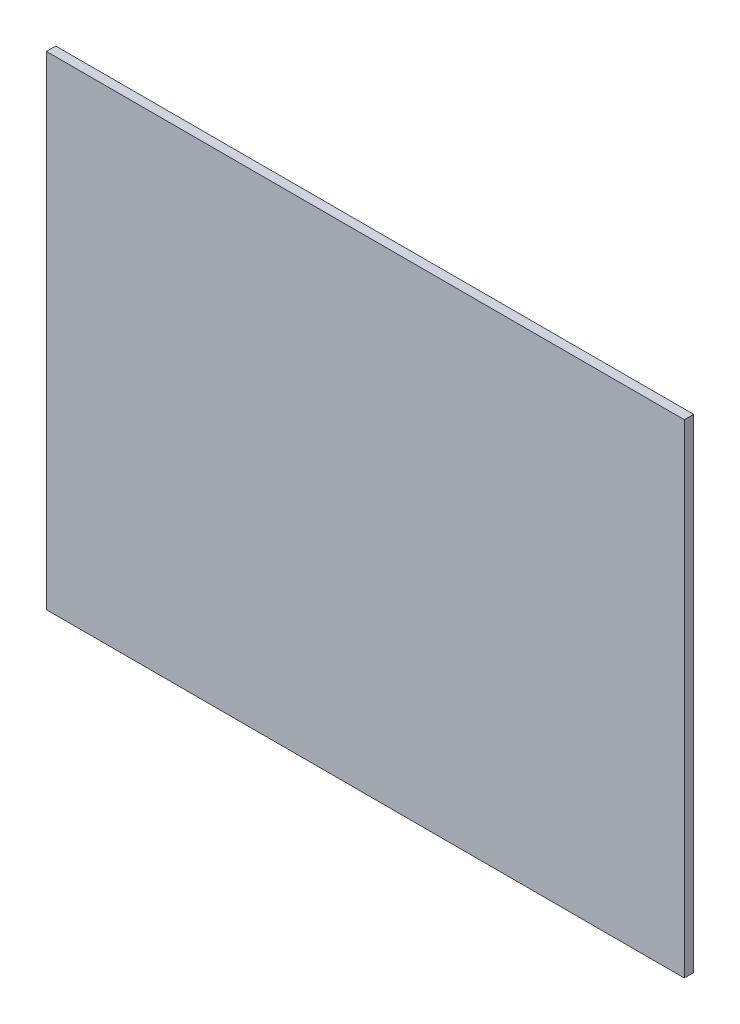
ISO-10303-21;
HEADER;
FILE_DESCRIPTION(('STEP AP214'),'2;1');
FILE_NAME('part.step','',(''),(''),'','','');
FILE_SCHEMA(('AUTOMOTIVE_DESIGN { 1 0 10303 214 1 1 1 1 }'));
ENDSEC;
DATA;
#1=APPLICATION_CONTEXT('core data for automotive mechanical design processes');
#2=APPLICATION_PROTOCOL_DEFINITION('international standard','automotive_design',2000,#1);
#3=PRODUCT_CONTEXT('',#1,'mechanical');
#4=PRODUCT('Part','Part','',(#3));
#5=PRODUCT_RELATED_PRODUCT_CATEGORY('part','',(#4));
#6=PRODUCT_DEFINITION_FORMATION('','',#4);
#7=PRODUCT_DEFINITION_CONTEXT('part definition',#1,'design');
#8=PRODUCT_DEFINITION('design','',#6,#7);
#9=PRODUCT_DEFINITION_SHAPE('','',#8);
#10=(LENGTH_UNIT() NAMED_UNIT(*) SI_UNIT(.MILLI.,.METRE.));
#11=(NAMED_UNIT(*) PLANE_ANGLE_UNIT() SI_UNIT($,.RADIAN.));
#12=(NAMED_UNIT(*) SI_UNIT($,.STERADIAN.) SOLID_ANGLE_UNIT());
#13=UNCERTAINTY_MEASURE_WITH_UNIT(LENGTH_MEASURE(1.E-05),#10,'distance_accuracy_value','');
#14=(GEOMETRIC_REPRESENTATION_CONTEXT(3) GLOBAL_UNCERTAINTY_ASSIGNED_CONTEXT((#13)) GLOBAL_UNIT_ASSIGNED_CONTEXT((#10,
#11,#12)) REPRESENTATION_CONTEXT('',''));
#15=CARTESIAN_POINT('',(0.,0.,0.));
#16=DIRECTION('',(0.,0.,1.));
#17=DIRECTION('',(1.,0.,0.));
#18=AXIS2_PLACEMENT_3D('',#15,#16,#17);
#19=CARTESIAN_POINT('',(19.4828493835392,-526.40036528036,3.));
#20=DIRECTION('',(1.,0.,0.));
#21=DIRECTION('',(0.,1.,0.));
#22=AXIS2_PLACEMENT_3D('',#19,#20,#21);
#23=PLANE('',#22);
#24=DIRECTION('',(0.,-1.,0.));
#25=VECTOR('',#24,1.);
#26=CARTESIAN_POINT('',(19.4828493835392,-526.40036528036,0.));
#27=LINE('',#26,#25);
#28=CARTESIAN_POINT('',(19.4828493835392,-526.40036528036,0.));
#29=VERTEX_POINT('',#28);
#30=CARTESIAN_POINT('',(19.4828493835393,-681.40036528036,0.));
#31=VERTEX_POINT('',#30);
#32=EDGE_CURVE('E95',#29,#31,#27,.T.);
#33=ORIENTED_EDGE('',*,*,#32,.T.);
#34=DIRECTION('',(0.,0.,-1.));
#35=VECTOR('',#34,1.);
#36=CARTESIAN_POINT('',(19.4828493835393,-681.40036528036,3.));
#37=LINE('',#36,#35);
#38=CARTESIAN_POINT('',(19.4828493835393,-681.40036528036,3.));
#39=VERTEX_POINT('',#38);
#40=EDGE_CURVE('E11',#39,#31,#37,.T.);
#41=ORIENTED_EDGE('',*,*,#40,.F.);
#42=DIRECTION('',(0.,-1.,0.));
#43=VECTOR('',#42,1.);
#44=CARTESIAN_POINT('',(19.4828493835392,-526.40036528036,3.));
#45=LINE('',#44,#43);
#46=CARTESIAN_POINT('',(19.4828493835392,-526.40036528036,3.));
#47=VERTEX_POINT('',#46);
#48=EDGE_CURVE('E83',#47,#39,#45,.T.);
#49=ORIENTED_EDGE('',*,*,#48,.F.);
#50=DIRECTION('',(0.,0.,-1.));
#51=VECTOR('',#50,1.);
#52=CARTESIAN_POINT('',(19.4828493835392,-526.40036528036,3.));
#53=LINE('',#52,#51);
#54=EDGE_CURVE('E91',#47,#29,#53,.T.);
#55=ORIENTED_EDGE('',*,*,#54,.T.);
#56=EDGE_LOOP('',(#33,#41,#49,#55));
#57=FACE_BOUND('',#56,.T.);
#58=ADVANCED_FACE('F32',(#57),#23,.F.);
#59=CARTESIAN_POINT('',(19.4828493835393,-681.40036528036,3.));
#60=DIRECTION('',(0.,1.,0.));
#61=DIRECTION('',(0.,0.,1.));
#62=AXIS2_PLACEMENT_3D('',#59,#60,#61);
#63=PLANE('',#62);
#64=DIRECTION('',(1.,0.,0.));
#65=VECTOR('',#64,1.);
#66=CARTESIAN_POINT('',(19.4828493835393,-681.40036528036,0.));
#67=LINE('',#66,#65);
#68=CARTESIAN_POINT('',(223.982849383539,-681.40036528036,0.));
#69=VERTEX_POINT('',#68);
#70=EDGE_CURVE('E87',#31,#69,#67,.T.);
#71=ORIENTED_EDGE('',*,*,#70,.T.);
#72=DIRECTION('',(0.,0.,-1.));
#73=VECTOR('',#72,1.);
#74=CARTESIAN_POINT('',(223.982849383539,-681.40036528036,3.));
#75=LINE('',#74,#73);
#76=CARTESIAN_POINT('',(223.982849383539,-681.40036528036,3.));
#77=VERTEX_POINT('',#76);
#78=EDGE_CURVE('E40',#77,#69,#75,.T.);
#79=ORIENTED_EDGE('',*,*,#78,.F.);
#80=DIRECTION('',(1.,0.,0.));
#81=VECTOR('',#80,1.);
#82=CARTESIAN_POINT('',(19.4828493835393,-681.40036528036,3.));
#83=LINE('',#82,#81);
#84=EDGE_CURVE('E78',#39,#77,#83,.T.);
#85=ORIENTED_EDGE('',*,*,#84,.F.);
#86=ORIENTED_EDGE('',*,*,#40,.T.);
#87=EDGE_LOOP('',(#71,#79,#85,#86));
#88=FACE_BOUND('',#87,.T.);
#89=ADVANCED_FACE('F86',(#88),#63,.F.);
#90=CARTESIAN_POINT('',(223.982849383539,-526.40036528036,3.));
#91=DIRECTION('',(-1.,0.,0.));
#92=DIRECTION('',(0.,-1.,0.));
#93=AXIS2_PLACEMENT_3D('',#90,#91,#92);
#94=PLANE('',#93);
#95=DIRECTION('',(0.,1.,0.));
#96=VECTOR('',#95,1.);
#97=CARTESIAN_POINT('',(223.982849383539,-526.40036528036,0.));
#98=LINE('',#97,#96);
#99=CARTESIAN_POINT('',(223.982849383539,-526.40036528036,0.));
#100=VERTEX_POINT('',#99);
#101=EDGE_CURVE('E65',#69,#100,#98,.T.);
#102=ORIENTED_EDGE('',*,*,#101,.T.);
#103=DIRECTION('',(0.,0.,-1.));
#104=VECTOR('',#103,1.);
#105=CARTESIAN_POINT('',(223.982849383539,-526.40036528036,3.));
#106=LINE('',#105,#104);
#107=CARTESIAN_POINT('',(223.982849383539,-526.40036528036,3.));
#108=VERTEX_POINT('',#107);
#109=EDGE_CURVE('E88',#108,#100,#106,.T.);
#110=ORIENTED_EDGE('',*,*,#109,.F.);
#111=DIRECTION('',(0.,1.,0.));
#112=VECTOR('',#111,1.);
#113=CARTESIAN_POINT('',(223.982849383539,-526.40036528036,3.));
#114=LINE('',#113,#112);
#115=EDGE_CURVE('E81',#77,#108,#114,.T.);
#116=ORIENTED_EDGE('',*,*,#115,.F.);
#117=ORIENTED_EDGE('',*,*,#78,.T.);
#118=EDGE_LOOP('',(#102,#110,#116,#117));
#119=FACE_BOUND('',#118,.T.);
#120=ADVANCED_FACE('F89',(#119),#94,.F.);
#121=CARTESIAN_POINT('',(19.4828493835392,-526.40036528036,3.));
#122=DIRECTION('',(0.,-1.,0.));
#123=DIRECTION('',(0.,0.,-1.));
#124=AXIS2_PLACEMENT_3D('',#121,#122,#123);
#125=PLANE('',#124);
#126=DIRECTION('',(-1.,0.,0.));
#127=VECTOR('',#126,1.);
#128=CARTESIAN_POINT('',(19.4828493835392,-526.40036528036,0.));
#129=LINE('',#128,#127);
#130=EDGE_CURVE('E71',#100,#29,#129,.T.);
#131=ORIENTED_EDGE('',*,*,#130,.T.);
#132=ORIENTED_EDGE('',*,*,#54,.F.);
#133=DIRECTION('',(-1.,0.,0.));
#134=VECTOR('',#133,1.);
#135=CARTESIAN_POINT('',(19.4828493835392,-526.40036528036,3.));
#136=LINE('',#135,#134);
#137=EDGE_CURVE('E48',#108,#47,#136,.T.);
#138=ORIENTED_EDGE('',*,*,#137,.F.);
#139=ORIENTED_EDGE('',*,*,#109,.T.);
#140=EDGE_LOOP('',(#131,#132,#138,#139));
#141=FACE_BOUND('',#140,.T.);
#142=ADVANCED_FACE('F102',(#141),#125,.F.);
#143=CARTESIAN_POINT('',(19.4828493835393,-681.40036528036,3.));
#144=DIRECTION('',(0.,0.,1.));
#145=DIRECTION('',(1.,0.,0.));
#146=AXIS2_PLACEMENT_3D('',#143,#144,#145);
#147=PLANE('',#146);
#148=ORIENTED_EDGE('',*,*,#48,.T.);
#149=ORIENTED_EDGE('',*,*,#84,.T.);
#150=ORIENTED_EDGE('',*,*,#115,.T.);
#151=ORIENTED_EDGE('',*,*,#137,.T.);
#152=EDGE_LOOP('',(#148,#149,#150,#151));
#153=FACE_BOUND('',#152,.T.);
#154=ADVANCED_FACE('F79',(#153),#147,.T.);
#155=CARTESIAN_POINT('',(19.4828493835393,-681.40036528036,0.));
#156=DIRECTION('',(0.,0.,1.));
#157=DIRECTION('',(1.,0.,0.));
#158=AXIS2_PLACEMENT_3D('',#155,#156,#157);
#159=PLANE('',#158);
#160=ORIENTED_EDGE('',*,*,#32,.F.);
#161=ORIENTED_EDGE('',*,*,#130,.F.);
#162=ORIENTED_EDGE('',*,*,#101,.F.);
#163=ORIENTED_EDGE('',*,*,#70,.F.);
#164=EDGE_LOOP('',(#160,#161,#162,#163));
#165=FACE_BOUND('',#164,.T.);
#166=ADVANCED_FACE('F105',(#165),#159,.F.);
#167=CLOSED_SHELL('',(#58,#89,#120,#142,#154,#166));
#168=MANIFOLD_SOLID_BREP('B2',#167);
#169=ADVANCED_BREP_SHAPE_REPRESENTATION('',(#18,#168),#14);
#170=SHAPE_DEFINITION_REPRESENTATION(#9,#169);
ENDSEC;
END-ISO-10303-21;
